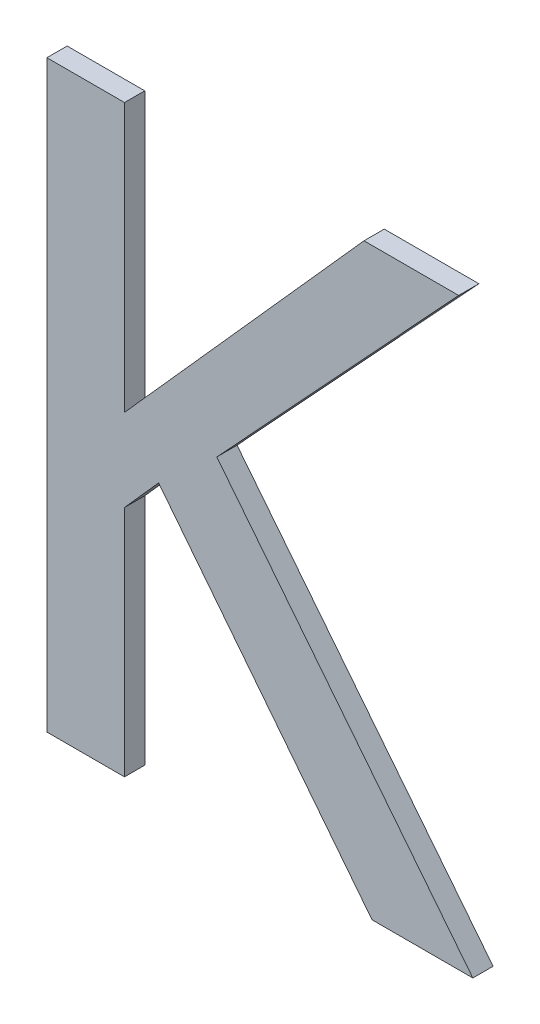
ISO-10303-21;
HEADER;
FILE_DESCRIPTION(('STEP AP214'),'2;1');
FILE_NAME('part.step','',(''),(''),'','','');
FILE_SCHEMA(('AUTOMOTIVE_DESIGN { 1 0 10303 214 1 1 1 1 }'));
ENDSEC;
DATA;
#1=APPLICATION_CONTEXT('core data for automotive mechanical design processes');
#2=APPLICATION_PROTOCOL_DEFINITION('international standard','automotive_design',2000,#1);
#3=PRODUCT_CONTEXT('',#1,'mechanical');
#4=PRODUCT('Part','Part','',(#3));
#5=PRODUCT_RELATED_PRODUCT_CATEGORY('part','',(#4));
#6=PRODUCT_DEFINITION_FORMATION('','',#4);
#7=PRODUCT_DEFINITION_CONTEXT('part definition',#1,'design');
#8=PRODUCT_DEFINITION('design','',#6,#7);
#9=PRODUCT_DEFINITION_SHAPE('','',#8);
#10=(LENGTH_UNIT() NAMED_UNIT(*) SI_UNIT(.MILLI.,.METRE.));
#11=(NAMED_UNIT(*) PLANE_ANGLE_UNIT() SI_UNIT($,.RADIAN.));
#12=(NAMED_UNIT(*) SI_UNIT($,.STERADIAN.) SOLID_ANGLE_UNIT());
#13=UNCERTAINTY_MEASURE_WITH_UNIT(LENGTH_MEASURE(1.E-05),#10,'distance_accuracy_value','');
#14=(GEOMETRIC_REPRESENTATION_CONTEXT(3) GLOBAL_UNCERTAINTY_ASSIGNED_CONTEXT((#13)) GLOBAL_UNIT_ASSIGNED_CONTEXT((#10,
#11,#12)) REPRESENTATION_CONTEXT('',''));
#15=CARTESIAN_POINT('',(0.,0.,0.));
#16=DIRECTION('',(0.,0.,1.));
#17=DIRECTION('',(1.,0.,0.));
#18=AXIS2_PLACEMENT_3D('',#15,#16,#17);
#19=CARTESIAN_POINT('',(-1.04128317344371,-1.32318589792872,0.0042));
#20=DIRECTION('',(0.,0.,1.));
#21=DIRECTION('',(1.,0.,0.));
#22=AXIS2_PLACEMENT_3D('',#19,#20,#21);
#23=PLANE('',#22);
#24=DIRECTION('',(1.,0.,0.));
#25=VECTOR('',#24,1.);
#26=CARTESIAN_POINT('',(-0.988260422305345,-1.4216556522388,0.0042));
#27=LINE('',#26,#25);
#28=CARTESIAN_POINT('',(-0.988260422305345,-1.4216556522388,0.0042));
#29=VERTEX_POINT('',#28);
#30=CARTESIAN_POINT('',(-0.954428980726608,-1.4216556522388,0.0042));
#31=VERTEX_POINT('',#30);
#32=EDGE_CURVE('E11',#29,#31,#27,.T.);
#33=ORIENTED_EDGE('',*,*,#32,.T.);
#34=DIRECTION('',(-0.620908701570166,0.783882889412985,0.));
#35=VECTOR('',#34,1.);
#36=CARTESIAN_POINT('',(-0.954428980726608,-1.4216556522388,0.0042));
#37=LINE('',#36,#35);
#38=CARTESIAN_POINT('',(-1.04035766567542,-1.31317267290416,0.0042));
#39=VERTEX_POINT('',#38);
#40=EDGE_CURVE('E119',#31,#39,#37,.T.);
#41=ORIENTED_EDGE('',*,*,#40,.T.);
#42=DIRECTION('',(0.679991598104566,0.733219903239947,0.));
#43=VECTOR('',#42,1.);
#44=CARTESIAN_POINT('',(-1.04035766567542,-1.31317267290416,0.0042));
#45=LINE('',#44,#43);
#46=CARTESIAN_POINT('',(-0.959193972498261,-1.2256556573648,0.0042));
#47=VERTEX_POINT('',#46);
#48=EDGE_CURVE('E192',#39,#47,#45,.T.);
#49=ORIENTED_EDGE('',*,*,#48,.T.);
#50=DIRECTION('',(-1.,0.,0.));
#51=VECTOR('',#50,1.);
#52=CARTESIAN_POINT('',(-0.959193972498261,-1.2256556573648,0.0042));
#53=LINE('',#52,#51);
#54=CARTESIAN_POINT('',(-0.990960584309282,-1.2256556573648,0.0042));
#55=VERTEX_POINT('',#54);
#56=EDGE_CURVE('E183',#47,#55,#53,.T.);
#57=ORIENTED_EDGE('',*,*,#56,.T.);
#58=DIRECTION('',(-0.66583270349198,-0.746101072885277,0.));
#59=VECTOR('',#58,1.);
#60=CARTESIAN_POINT('',(-0.990960584309282,-1.2256556573648,0.0042));
#61=LINE('',#60,#59);
#62=CARTESIAN_POINT('',(-1.07133011219117,-1.31571400184904,0.0042));
#63=VERTEX_POINT('',#62);
#64=EDGE_CURVE('E173',#55,#63,#61,.T.);
#65=ORIENTED_EDGE('',*,*,#64,.T.);
#66=DIRECTION('',(0.,1.,0.));
#67=VECTOR('',#66,1.);
#68=CARTESIAN_POINT('',(-1.07133011219117,-1.31571400184904,0.0042));
#69=LINE('',#68,#67);
#70=CARTESIAN_POINT('',(-1.07133011219117,-1.2256556573648,0.0042));
#71=VERTEX_POINT('',#70);
#72=EDGE_CURVE('E163',#63,#71,#69,.T.);
#73=ORIENTED_EDGE('',*,*,#72,.T.);
#74=DIRECTION('',(-1.,0.,0.));
#75=VECTOR('',#74,1.);
#76=CARTESIAN_POINT('',(-1.07133011219117,-1.2256556573648,0.0042));
#77=LINE('',#76,#75);
#78=CARTESIAN_POINT('',(-1.0973787338762,-1.2256556573648,0.0042));
#79=VERTEX_POINT('',#78);
#80=EDGE_CURVE('E153',#71,#79,#77,.T.);
#81=ORIENTED_EDGE('',*,*,#80,.T.);
#82=DIRECTION('',(0.,-1.,0.));
#83=VECTOR('',#82,1.);
#84=CARTESIAN_POINT('',(-1.0973787338762,-1.2256556573648,0.0042));
#85=LINE('',#84,#83);
#86=CARTESIAN_POINT('',(-1.0973787338762,-1.4216556522388,0.0042));
#87=VERTEX_POINT('',#86);
#88=EDGE_CURVE('E144',#79,#87,#85,.T.);
#89=ORIENTED_EDGE('',*,*,#88,.T.);
#90=DIRECTION('',(1.,0.,0.));
#91=VECTOR('',#90,1.);
#92=CARTESIAN_POINT('',(-1.0973787338762,-1.4216556522388,0.0042));
#93=LINE('',#92,#91);
#94=CARTESIAN_POINT('',(-1.07133011219117,-1.4216556522388,0.0042));
#95=VERTEX_POINT('',#94);
#96=EDGE_CURVE('E155',#87,#95,#93,.T.);
#97=ORIENTED_EDGE('',*,*,#96,.T.);
#98=DIRECTION('',(0.,1.,0.));
#99=VECTOR('',#98,1.);
#100=CARTESIAN_POINT('',(-1.07133011219117,-1.4216556522388,0.0042));
#101=LINE('',#100,#99);
#102=CARTESIAN_POINT('',(-1.07133011219117,-1.34335095412463,0.0042));
#103=VERTEX_POINT('',#102);
#104=EDGE_CURVE('E165',#95,#103,#101,.T.);
#105=ORIENTED_EDGE('',*,*,#104,.T.);
#106=DIRECTION('',(0.664363838829925,0.747409318683655,0.));
#107=VECTOR('',#106,1.);
#108=CARTESIAN_POINT('',(-1.07133011219117,-1.34335095412463,0.0042));
#109=LINE('',#108,#107);
#110=CARTESIAN_POINT('',(-1.0598941319392,-1.33048547634117,0.0042));
#111=VERTEX_POINT('',#110);
#112=EDGE_CURVE('E175',#103,#111,#109,.T.);
#113=ORIENTED_EDGE('',*,*,#112,.T.);
#114=DIRECTION('',(0.617821551931903,-0.786318338822423,0.));
#115=VECTOR('',#114,1.);
#116=CARTESIAN_POINT('',(-1.0598941319392,-1.33048547634117,0.0042));
#117=LINE('',#116,#115);
#118=EDGE_CURVE('E185',#111,#29,#117,.T.);
#119=ORIENTED_EDGE('',*,*,#118,.T.);
#120=EDGE_LOOP('',(#33,#41,#49,#57,#65,#73,#81,#89,#97,#105,#113,#119));
#121=FACE_BOUND('',#120,.T.);
#122=ADVANCED_FACE('F17',(#121),#23,.T.);
#123=CARTESIAN_POINT('',(-1.0598941319392,-1.33048547634117,-0.0026));
#124=DIRECTION('',(-0.786318338822423,-0.617821551931904,0.));
#125=DIRECTION('',(0.617821551931904,-0.786318338822423,0.));
#126=AXIS2_PLACEMENT_3D('',#123,#124,#125);
#127=PLANE('',#126);
#128=DIRECTION('',(-0.617821551931903,0.786318338822423,0.));
#129=VECTOR('',#128,1.);
#130=CARTESIAN_POINT('',(-0.988260422305345,-1.4216556522388,-0.0026));
#131=LINE('',#130,#129);
#132=CARTESIAN_POINT('',(-0.988260422305345,-1.4216556522388,-0.0026));
#133=VERTEX_POINT('',#132);
#134=CARTESIAN_POINT('',(-1.0598941319392,-1.33048547634117,-0.0026));
#135=VERTEX_POINT('',#134);
#136=EDGE_CURVE('E24',#133,#135,#131,.T.);
#137=ORIENTED_EDGE('',*,*,#136,.F.);
#138=DIRECTION('',(0.,0.,1.));
#139=VECTOR('',#138,1.);
#140=CARTESIAN_POINT('',(-0.988260422305345,-1.4216556522388,-0.0026));
#141=LINE('',#140,#139);
#142=EDGE_CURVE('E108',#133,#29,#141,.T.);
#143=ORIENTED_EDGE('',*,*,#142,.T.);
#144=ORIENTED_EDGE('',*,*,#118,.F.);
#145=DIRECTION('',(0.,0.,1.));
#146=VECTOR('',#145,1.);
#147=CARTESIAN_POINT('',(-1.0598941319392,-1.33048547634117,-0.0026));
#148=LINE('',#147,#146);
#149=EDGE_CURVE('E187',#135,#111,#148,.T.);
#150=ORIENTED_EDGE('',*,*,#149,.F.);
#151=EDGE_LOOP('',(#137,#143,#144,#150));
#152=FACE_BOUND('',#151,.T.);
#153=ADVANCED_FACE('F203',(#152),#127,.T.);
#154=CARTESIAN_POINT('',(-1.07133011219117,-1.34335095412463,-0.0026));
#155=DIRECTION('',(0.747409318683659,-0.664363838829921,0.));
#156=DIRECTION('',(0.664363838829921,0.747409318683659,0.));
#157=AXIS2_PLACEMENT_3D('',#154,#155,#156);
#158=PLANE('',#157);
#159=DIRECTION('',(-0.664363838829919,-0.74740931868366,0.));
#160=VECTOR('',#159,1.);
#161=CARTESIAN_POINT('',(-1.0598941319392,-1.33048547634117,-0.0026));
#162=LINE('',#161,#160);
#163=CARTESIAN_POINT('',(-1.07133011219117,-1.34335095412463,-0.0026));
#164=VERTEX_POINT('',#163);
#165=EDGE_CURVE('E195',#135,#164,#162,.T.);
#166=ORIENTED_EDGE('',*,*,#165,.F.);
#167=ORIENTED_EDGE('',*,*,#149,.T.);
#168=ORIENTED_EDGE('',*,*,#112,.F.);
#169=DIRECTION('',(0.,0.,1.));
#170=VECTOR('',#169,1.);
#171=CARTESIAN_POINT('',(-1.07133011219117,-1.34335095412463,-0.0026));
#172=LINE('',#171,#170);
#173=EDGE_CURVE('E178',#164,#103,#172,.T.);
#174=ORIENTED_EDGE('',*,*,#173,.F.);
#175=EDGE_LOOP('',(#166,#167,#168,#174));
#176=FACE_BOUND('',#175,.T.);
#177=ADVANCED_FACE('F200',(#176),#158,.T.);
#178=CARTESIAN_POINT('',(-1.07133011219117,-1.4216556522388,-0.0026));
#179=DIRECTION('',(1.,0.,0.));
#180=DIRECTION('',(0.,1.,0.));
#181=AXIS2_PLACEMENT_3D('',#178,#179,#180);
#182=PLANE('',#181);
#183=DIRECTION('',(0.,-1.,0.));
#184=VECTOR('',#183,1.);
#185=CARTESIAN_POINT('',(-1.07133011219117,-1.34335095412463,-0.0026));
#186=LINE('',#185,#184);
#187=CARTESIAN_POINT('',(-1.07133011219117,-1.4216556522388,-0.0026));
#188=VERTEX_POINT('',#187);
#189=EDGE_CURVE('E189',#164,#188,#186,.T.);
#190=ORIENTED_EDGE('',*,*,#189,.F.);
#191=ORIENTED_EDGE('',*,*,#173,.T.);
#192=ORIENTED_EDGE('',*,*,#104,.F.);
#193=DIRECTION('',(0.,0.,1.));
#194=VECTOR('',#193,1.);
#195=CARTESIAN_POINT('',(-1.07133011219117,-1.4216556522388,-0.0026));
#196=LINE('',#195,#194);
#197=EDGE_CURVE('E168',#188,#95,#196,.T.);
#198=ORIENTED_EDGE('',*,*,#197,.F.);
#199=EDGE_LOOP('',(#190,#191,#192,#198));
#200=FACE_BOUND('',#199,.T.);
#201=ADVANCED_FACE('F208',(#200),#182,.T.);
#202=CARTESIAN_POINT('',(-1.0973787338762,-1.4216556522388,-0.0026));
#203=DIRECTION('',(0.,-1.,0.));
#204=DIRECTION('',(1.,0.,0.));
#205=AXIS2_PLACEMENT_3D('',#202,#203,#204);
#206=PLANE('',#205);
#207=DIRECTION('',(-1.,0.,0.));
#208=VECTOR('',#207,1.);
#209=CARTESIAN_POINT('',(-1.07133011219117,-1.4216556522388,-0.0026));
#210=LINE('',#209,#208);
#211=CARTESIAN_POINT('',(-1.0973787338762,-1.4216556522388,-0.0026));
#212=VERTEX_POINT('',#211);
#213=EDGE_CURVE('E180',#188,#212,#210,.T.);
#214=ORIENTED_EDGE('',*,*,#213,.F.);
#215=ORIENTED_EDGE('',*,*,#197,.T.);
#216=ORIENTED_EDGE('',*,*,#96,.F.);
#217=DIRECTION('',(0.,0.,1.));
#218=VECTOR('',#217,1.);
#219=CARTESIAN_POINT('',(-1.0973787338762,-1.4216556522388,-0.0026));
#220=LINE('',#219,#218);
#221=EDGE_CURVE('E158',#212,#87,#220,.T.);
#222=ORIENTED_EDGE('',*,*,#221,.F.);
#223=EDGE_LOOP('',(#214,#215,#216,#222));
#224=FACE_BOUND('',#223,.T.);
#225=ADVANCED_FACE('F210',(#224),#206,.T.);
#226=CARTESIAN_POINT('',(-1.0973787338762,-1.2256556573648,-0.0026));
#227=DIRECTION('',(-1.,0.,0.));
#228=DIRECTION('',(0.,-1.,0.));
#229=AXIS2_PLACEMENT_3D('',#226,#227,#228);
#230=PLANE('',#229);
#231=DIRECTION('',(0.,1.,0.));
#232=VECTOR('',#231,1.);
#233=CARTESIAN_POINT('',(-1.0973787338762,-1.4216556522388,-0.0026));
#234=LINE('',#233,#232);
#235=CARTESIAN_POINT('',(-1.0973787338762,-1.2256556573648,-0.0026));
#236=VERTEX_POINT('',#235);
#237=EDGE_CURVE('E170',#212,#236,#234,.T.);
#238=ORIENTED_EDGE('',*,*,#237,.F.);
#239=ORIENTED_EDGE('',*,*,#221,.T.);
#240=ORIENTED_EDGE('',*,*,#88,.F.);
#241=DIRECTION('',(0.,0.,1.));
#242=VECTOR('',#241,1.);
#243=CARTESIAN_POINT('',(-1.0973787338762,-1.2256556573648,-0.0026));
#244=LINE('',#243,#242);
#245=EDGE_CURVE('E147',#236,#79,#244,.T.);
#246=ORIENTED_EDGE('',*,*,#245,.F.);
#247=EDGE_LOOP('',(#238,#239,#240,#246));
#248=FACE_BOUND('',#247,.T.);
#249=ADVANCED_FACE('F214',(#248),#230,.T.);
#250=CARTESIAN_POINT('',(-1.07133011219117,-1.2256556573648,-0.0026));
#251=DIRECTION('',(0.,1.,0.));
#252=DIRECTION('',(-1.,0.,0.));
#253=AXIS2_PLACEMENT_3D('',#250,#251,#252);
#254=PLANE('',#253);
#255=DIRECTION('',(1.,0.,0.));
#256=VECTOR('',#255,1.);
#257=CARTESIAN_POINT('',(-1.0973787338762,-1.2256556573648,-0.0026));
#258=LINE('',#257,#256);
#259=CARTESIAN_POINT('',(-1.07133011219117,-1.2256556573648,-0.0026));
#260=VERTEX_POINT('',#259);
#261=EDGE_CURVE('E160',#236,#260,#258,.T.);
#262=ORIENTED_EDGE('',*,*,#261,.F.);
#263=ORIENTED_EDGE('',*,*,#245,.T.);
#264=ORIENTED_EDGE('',*,*,#80,.F.);
#265=DIRECTION('',(0.,0.,1.));
#266=VECTOR('',#265,1.);
#267=CARTESIAN_POINT('',(-1.07133011219117,-1.2256556573648,-0.0026));
#268=LINE('',#267,#266);
#269=EDGE_CURVE('E138',#260,#71,#268,.T.);
#270=ORIENTED_EDGE('',*,*,#269,.F.);
#271=EDGE_LOOP('',(#262,#263,#264,#270));
#272=FACE_BOUND('',#271,.T.);
#273=ADVANCED_FACE('F218',(#272),#254,.T.);
#274=CARTESIAN_POINT('',(-1.07133011219117,-1.31571400184904,-0.0026));
#275=DIRECTION('',(1.,0.,0.));
#276=DIRECTION('',(0.,1.,0.));
#277=AXIS2_PLACEMENT_3D('',#274,#275,#276);
#278=PLANE('',#277);
#279=DIRECTION('',(0.,-1.,0.));
#280=VECTOR('',#279,1.);
#281=CARTESIAN_POINT('',(-1.07133011219117,-1.2256556573648,-0.0026));
#282=LINE('',#281,#280);
#283=CARTESIAN_POINT('',(-1.07133011219117,-1.31571400184904,-0.0026));
#284=VERTEX_POINT('',#283);
#285=EDGE_CURVE('E150',#260,#284,#282,.T.);
#286=ORIENTED_EDGE('',*,*,#285,.F.);
#287=ORIENTED_EDGE('',*,*,#269,.T.);
#288=ORIENTED_EDGE('',*,*,#72,.F.);
#289=DIRECTION('',(0.,0.,1.));
#290=VECTOR('',#289,1.);
#291=CARTESIAN_POINT('',(-1.07133011219117,-1.31571400184904,-0.0026));
#292=LINE('',#291,#290);
#293=EDGE_CURVE('E133',#284,#63,#292,.T.);
#294=ORIENTED_EDGE('',*,*,#293,.F.);
#295=EDGE_LOOP('',(#286,#287,#288,#294));
#296=FACE_BOUND('',#295,.T.);
#297=ADVANCED_FACE('F222',(#296),#278,.T.);
#298=CARTESIAN_POINT('',(-0.990960584309282,-1.2256556573648,-0.0026));
#299=DIRECTION('',(-0.746101072885279,0.665832703491977,0.));
#300=DIRECTION('',(-0.665832703491977,-0.746101072885279,0.));
#301=AXIS2_PLACEMENT_3D('',#298,#299,#300);
#302=PLANE('',#301);
#303=DIRECTION('',(0.665832703491977,0.746101072885279,0.));
#304=VECTOR('',#303,1.);
#305=CARTESIAN_POINT('',(-1.07133011219117,-1.31571400184904,-0.0026));
#306=LINE('',#305,#304);
#307=CARTESIAN_POINT('',(-0.990960584309282,-1.2256556573648,-0.0026));
#308=VERTEX_POINT('',#307);
#309=EDGE_CURVE('E141',#284,#308,#306,.T.);
#310=ORIENTED_EDGE('',*,*,#309,.F.);
#311=ORIENTED_EDGE('',*,*,#293,.T.);
#312=ORIENTED_EDGE('',*,*,#64,.F.);
#313=DIRECTION('',(0.,0.,1.));
#314=VECTOR('',#313,1.);
#315=CARTESIAN_POINT('',(-0.990960584309282,-1.2256556573648,-0.0026));
#316=LINE('',#315,#314);
#317=EDGE_CURVE('E125',#308,#55,#316,.T.);
#318=ORIENTED_EDGE('',*,*,#317,.F.);
#319=EDGE_LOOP('',(#310,#311,#312,#318));
#320=FACE_BOUND('',#319,.T.);
#321=ADVANCED_FACE('F226',(#320),#302,.T.);
#322=CARTESIAN_POINT('',(-0.959193972498261,-1.2256556573648,-0.0026));
#323=DIRECTION('',(0.,1.,0.));
#324=DIRECTION('',(-1.,0.,0.));
#325=AXIS2_PLACEMENT_3D('',#322,#323,#324);
#326=PLANE('',#325);
#327=DIRECTION('',(1.,0.,0.));
#328=VECTOR('',#327,1.);
#329=CARTESIAN_POINT('',(-0.990960584309282,-1.2256556573648,-0.0026));
#330=LINE('',#329,#328);
#331=CARTESIAN_POINT('',(-0.959193972498261,-1.2256556573648,-0.0026));
#332=VERTEX_POINT('',#331);
#333=EDGE_CURVE('E136',#308,#332,#330,.T.);
#334=ORIENTED_EDGE('',*,*,#333,.F.);
#335=ORIENTED_EDGE('',*,*,#317,.T.);
#336=ORIENTED_EDGE('',*,*,#56,.F.);
#337=DIRECTION('',(0.,0.,1.));
#338=VECTOR('',#337,1.);
#339=CARTESIAN_POINT('',(-0.959193972498261,-1.2256556573648,-0.0026));
#340=LINE('',#339,#338);
#341=EDGE_CURVE('E111',#332,#47,#340,.T.);
#342=ORIENTED_EDGE('',*,*,#341,.F.);
#343=EDGE_LOOP('',(#334,#335,#336,#342));
#344=FACE_BOUND('',#343,.T.);
#345=ADVANCED_FACE('F230',(#344),#326,.T.);
#346=CARTESIAN_POINT('',(-1.04035766567542,-1.31317267290416,-0.0026));
#347=DIRECTION('',(0.73321990323995,-0.679991598104563,0.));
#348=DIRECTION('',(0.679991598104563,0.73321990323995,0.));
#349=AXIS2_PLACEMENT_3D('',#346,#347,#348);
#350=PLANE('',#349);
#351=DIRECTION('',(-0.679991598104564,-0.73321990323995,0.));
#352=VECTOR('',#351,1.);
#353=CARTESIAN_POINT('',(-0.959193972498261,-1.2256556573648,-0.0026));
#354=LINE('',#353,#352);
#355=CARTESIAN_POINT('',(-1.04035766567542,-1.31317267290416,-0.0026));
#356=VERTEX_POINT('',#355);
#357=EDGE_CURVE('E124',#332,#356,#354,.T.);
#358=ORIENTED_EDGE('',*,*,#357,.F.);
#359=ORIENTED_EDGE('',*,*,#341,.T.);
#360=ORIENTED_EDGE('',*,*,#48,.F.);
#361=DIRECTION('',(0.,0.,1.));
#362=VECTOR('',#361,1.);
#363=CARTESIAN_POINT('',(-1.04035766567542,-1.31317267290416,-0.0026));
#364=LINE('',#363,#362);
#365=EDGE_CURVE('E112',#356,#39,#364,.T.);
#366=ORIENTED_EDGE('',*,*,#365,.F.);
#367=EDGE_LOOP('',(#358,#359,#360,#366));
#368=FACE_BOUND('',#367,.T.);
#369=ADVANCED_FACE('F234',(#368),#350,.T.);
#370=CARTESIAN_POINT('',(-0.954428980726608,-1.4216556522388,-0.0026));
#371=DIRECTION('',(0.783882889412984,0.620908701570168,0.));
#372=DIRECTION('',(-0.620908701570168,0.783882889412984,0.));
#373=AXIS2_PLACEMENT_3D('',#370,#371,#372);
#374=PLANE('',#373);
#375=DIRECTION('',(0.620908701570168,-0.783882889412984,0.));
#376=VECTOR('',#375,1.);
#377=CARTESIAN_POINT('',(-1.04035766567542,-1.31317267290416,-0.0026));
#378=LINE('',#377,#376);
#379=CARTESIAN_POINT('',(-0.954428980726608,-1.4216556522388,-0.0026));
#380=VERTEX_POINT('',#379);
#381=EDGE_CURVE('E117',#356,#380,#378,.T.);
#382=ORIENTED_EDGE('',*,*,#381,.F.);
#383=ORIENTED_EDGE('',*,*,#365,.T.);
#384=ORIENTED_EDGE('',*,*,#40,.F.);
#385=DIRECTION('',(0.,0.,1.));
#386=VECTOR('',#385,1.);
#387=CARTESIAN_POINT('',(-0.954428980726608,-1.4216556522388,-0.0026));
#388=LINE('',#387,#386);
#389=EDGE_CURVE('E106',#380,#31,#388,.T.);
#390=ORIENTED_EDGE('',*,*,#389,.F.);
#391=EDGE_LOOP('',(#382,#383,#384,#390));
#392=FACE_BOUND('',#391,.T.);
#393=ADVANCED_FACE('F115',(#392),#374,.T.);
#394=CARTESIAN_POINT('',(-0.988260422305345,-1.4216556522388,-0.0026));
#395=DIRECTION('',(0.,-1.,0.));
#396=DIRECTION('',(1.,0.,0.));
#397=AXIS2_PLACEMENT_3D('',#394,#395,#396);
#398=PLANE('',#397);
#399=DIRECTION('',(-1.,0.,0.));
#400=VECTOR('',#399,1.);
#401=CARTESIAN_POINT('',(-0.954428980726608,-1.4216556522388,-0.0026));
#402=LINE('',#401,#400);
#403=EDGE_CURVE('E103',#380,#133,#402,.T.);
#404=ORIENTED_EDGE('',*,*,#403,.F.);
#405=ORIENTED_EDGE('',*,*,#389,.T.);
#406=ORIENTED_EDGE('',*,*,#32,.F.);
#407=ORIENTED_EDGE('',*,*,#142,.F.);
#408=EDGE_LOOP('',(#404,#405,#406,#407));
#409=FACE_BOUND('',#408,.T.);
#410=ADVANCED_FACE('F105',(#409),#398,.T.);
#411=CARTESIAN_POINT('',(-1.04128317344371,-1.32318589792872,-0.0026));
#412=DIRECTION('',(0.,0.,1.));
#413=DIRECTION('',(1.,0.,0.));
#414=AXIS2_PLACEMENT_3D('',#411,#412,#413);
#415=PLANE('',#414);
#416=ORIENTED_EDGE('',*,*,#403,.T.);
#417=ORIENTED_EDGE('',*,*,#136,.T.);
#418=ORIENTED_EDGE('',*,*,#165,.T.);
#419=ORIENTED_EDGE('',*,*,#189,.T.);
#420=ORIENTED_EDGE('',*,*,#213,.T.);
#421=ORIENTED_EDGE('',*,*,#237,.T.);
#422=ORIENTED_EDGE('',*,*,#261,.T.);
#423=ORIENTED_EDGE('',*,*,#285,.T.);
#424=ORIENTED_EDGE('',*,*,#309,.T.);
#425=ORIENTED_EDGE('',*,*,#333,.T.);
#426=ORIENTED_EDGE('',*,*,#357,.T.);
#427=ORIENTED_EDGE('',*,*,#381,.T.);
#428=EDGE_LOOP('',(#416,#417,#418,#419,#420,#421,#422,#423,#424,#425,#426,#427));
#429=FACE_BOUND('',#428,.T.);
#430=ADVANCED_FACE('F122',(#429),#415,.F.);
#431=CLOSED_SHELL('',(#122,#153,#177,#201,#225,#249,#273,#297,#321,#345,#369,#393,#410,#430));
#432=MANIFOLD_SOLID_BREP('B1',#431);
#433=ADVANCED_BREP_SHAPE_REPRESENTATION('',(#18,#432),#14);
#434=SHAPE_DEFINITION_REPRESENTATION(#9,#433);
ENDSEC;
END-ISO-10303-21;
